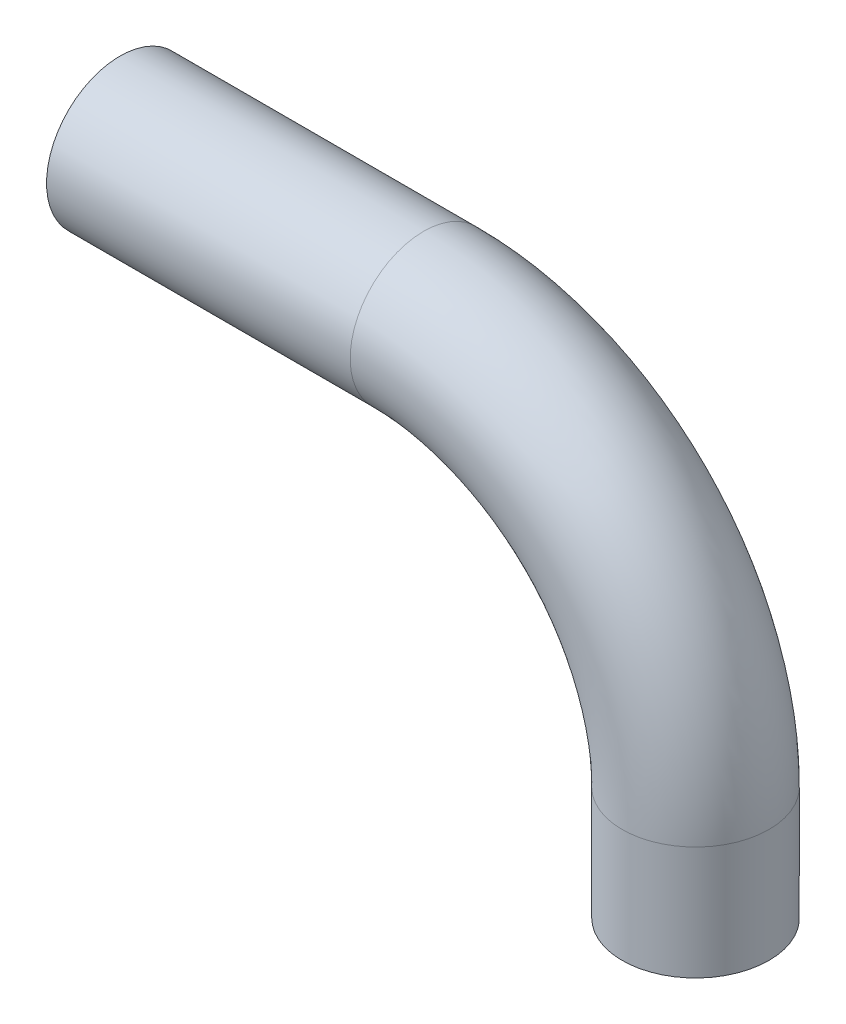
ISO-10303-21;
HEADER;
FILE_DESCRIPTION(('STEP AP214'),'2;1');
FILE_NAME('part.step','',(''),(''),'','','');
FILE_SCHEMA(('AUTOMOTIVE_DESIGN { 1 0 10303 214 1 1 1 1 }'));
ENDSEC;
DATA;
#1=APPLICATION_CONTEXT('core data for automotive mechanical design processes');
#2=APPLICATION_PROTOCOL_DEFINITION('international standard','automotive_design',2000,#1);
#3=PRODUCT_CONTEXT('',#1,'mechanical');
#4=PRODUCT('Part','Part','',(#3));
#5=PRODUCT_RELATED_PRODUCT_CATEGORY('part','',(#4));
#6=PRODUCT_DEFINITION_FORMATION('','',#4);
#7=PRODUCT_DEFINITION_CONTEXT('part definition',#1,'design');
#8=PRODUCT_DEFINITION('design','',#6,#7);
#9=PRODUCT_DEFINITION_SHAPE('','',#8);
#10=(LENGTH_UNIT() NAMED_UNIT(*) SI_UNIT(.MILLI.,.METRE.));
#11=(NAMED_UNIT(*) PLANE_ANGLE_UNIT() SI_UNIT($,.RADIAN.));
#12=(NAMED_UNIT(*) SI_UNIT($,.STERADIAN.) SOLID_ANGLE_UNIT());
#13=UNCERTAINTY_MEASURE_WITH_UNIT(LENGTH_MEASURE(1.E-05),#10,'distance_accuracy_value','');
#14=(GEOMETRIC_REPRESENTATION_CONTEXT(3) GLOBAL_UNCERTAINTY_ASSIGNED_CONTEXT((#13)) GLOBAL_UNIT_ASSIGNED_CONTEXT((#10,
#11,#12)) REPRESENTATION_CONTEXT('',''));
#15=CARTESIAN_POINT('',(0.,0.,0.));
#16=DIRECTION('',(0.,0.,1.));
#17=DIRECTION('',(1.,0.,0.));
#18=AXIS2_PLACEMENT_3D('',#15,#16,#17);
#19=CARTESIAN_POINT('',(0.,0.,0.));
#20=DIRECTION('',(1.,0.,0.));
#21=DIRECTION('',(0.,0.,-1.));
#22=AXIS2_PLACEMENT_3D('',#19,#20,#21);
#23=PLANE('',#22);
#24=CARTESIAN_POINT('',(0.,0.,0.));
#25=DIRECTION('',(1.,0.,0.));
#26=DIRECTION('',(0.,0.,-1.));
#27=AXIS2_PLACEMENT_3D('',#24,#25,#26);
#28=CIRCLE('',#27,13.1);
#29=CARTESIAN_POINT('',(0.,0.,-13.1));
#30=VERTEX_POINT('',#29);
#31=EDGE_CURVE('E61',#30,#30,#28,.T.);
#32=ORIENTED_EDGE('',*,*,#31,.T.);
#33=EDGE_LOOP('',(#32));
#34=FACE_BOUND('',#33,.T.);
#35=CARTESIAN_POINT('',(0.,0.,0.));
#36=DIRECTION('',(1.,0.,0.));
#37=DIRECTION('',(0.,0.,-1.));
#38=AXIS2_PLACEMENT_3D('',#35,#36,#37);
#39=CIRCLE('',#38,13.5000000000005);
#40=CARTESIAN_POINT('',(0.,0.,-13.5000000000005));
#41=VERTEX_POINT('',#40);
#42=EDGE_CURVE('E49',#41,#41,#39,.T.);
#43=ORIENTED_EDGE('',*,*,#42,.F.);
#44=EDGE_LOOP('',(#43));
#45=FACE_BOUND('',#44,.T.);
#46=ADVANCED_FACE('F35',(#34,#45),#23,.F.);
#47=CARTESIAN_POINT('',(105.822460270411,-70.8519707007333,0.));
#48=DIRECTION('',(0.,-1.,0.));
#49=DIRECTION('',(0.,0.,-1.));
#50=AXIS2_PLACEMENT_3D('',#47,#48,#49);
#51=PLANE('',#50);
#52=CARTESIAN_POINT('',(105.822460270411,-70.8519707007333,0.));
#53=DIRECTION('',(0.,-1.,0.));
#54=DIRECTION('',(1.,0.,0.));
#55=AXIS2_PLACEMENT_3D('',#52,#53,#54);
#56=CIRCLE('',#55,13.1);
#57=CARTESIAN_POINT('',(118.922460270411,-70.8519707007333,0.));
#58=VERTEX_POINT('',#57);
#59=EDGE_CURVE('E54',#58,#58,#56,.T.);
#60=ORIENTED_EDGE('',*,*,#59,.F.);
#61=EDGE_LOOP('',(#60));
#62=FACE_BOUND('',#61,.T.);
#63=CARTESIAN_POINT('',(105.822460270411,-70.8519707007333,0.));
#64=DIRECTION('',(0.,-1.,0.));
#65=DIRECTION('',(0.,0.,-1.));
#66=AXIS2_PLACEMENT_3D('',#63,#64,#65);
#67=CIRCLE('',#66,13.5000000000005);
#68=CARTESIAN_POINT('',(105.822460270411,-70.8519707007333,-13.5000000000005));
#69=VERTEX_POINT('',#68);
#70=EDGE_CURVE('E10',#69,#69,#67,.T.);
#71=ORIENTED_EDGE('',*,*,#70,.T.);
#72=EDGE_LOOP('',(#71));
#73=FACE_BOUND('',#72,.T.);
#74=ADVANCED_FACE('F98',(#62,#73),#51,.T.);
#75=CARTESIAN_POINT('',(0.,0.,0.));
#76=DIRECTION('',(1.,0.,0.));
#77=DIRECTION('',(0.,0.,-1.));
#78=AXIS2_PLACEMENT_3D('',#75,#76,#77);
#79=CYLINDRICAL_SURFACE('',#78,13.5000000000005);
#80=CARTESIAN_POINT('',(55.8224602704109,0.,0.));
#81=DIRECTION('',(1.,0.,0.));
#82=DIRECTION('',(0.,0.,-1.));
#83=AXIS2_PLACEMENT_3D('',#80,#81,#82);
#84=CIRCLE('',#83,13.5000000000005);
#85=CARTESIAN_POINT('',(55.8224602704109,13.5000000000005,0.));
#86=VERTEX_POINT('',#85);
#87=EDGE_CURVE('E45',#86,#86,#84,.T.);
#88=ORIENTED_EDGE('',*,*,#87,.F.);
#89=EDGE_LOOP('',(#88));
#90=FACE_BOUND('',#89,.T.);
#91=ORIENTED_EDGE('',*,*,#42,.T.);
#92=EDGE_LOOP('',(#91));
#93=FACE_BOUND('',#92,.T.);
#94=ADVANCED_FACE('F94',(#90,#93),#79,.T.);
#95=CARTESIAN_POINT('',(55.8224602704109,-50.,0.));
#96=DIRECTION('',(0.,0.,-1.));
#97=DIRECTION('',(-1.,0.,0.));
#98=AXIS2_PLACEMENT_3D('',#95,#96,#97);
#99=TOROIDAL_SURFACE('',#98,50.,13.5000000000005);
#100=CARTESIAN_POINT('',(105.822460270411,-50.,0.));
#101=DIRECTION('',(0.,-1.,0.));
#102=DIRECTION('',(0.,0.,-1.));
#103=AXIS2_PLACEMENT_3D('',#100,#101,#102);
#104=CIRCLE('',#103,13.5000000000005);
#105=CARTESIAN_POINT('',(119.322460270411,-50.,0.));
#106=VERTEX_POINT('',#105);
#107=EDGE_CURVE('E41',#106,#106,#104,.T.);
#108=CARTESIAN_POINT('',(55.8224602704109,-50.,0.));
#109=DIRECTION('',(0.,0.,-1.));
#110=DIRECTION('',(-1.,0.,0.));
#111=AXIS2_PLACEMENT_3D('',#108,#109,#110);
#112=CIRCLE('',#111,63.5000000000005);
#113=EDGE_CURVE('',#86,#106,#112,.T.);
#114=ORIENTED_EDGE('',*,*,#87,.T.);
#115=ORIENTED_EDGE('',*,*,#107,.F.);
#116=ORIENTED_EDGE('',*,*,#113,.T.);
#117=ORIENTED_EDGE('',*,*,#113,.F.);
#118=EDGE_LOOP('',(#114,#116,#115,#117));
#119=FACE_BOUND('',#118,.T.);
#120=ADVANCED_FACE('F88',(#119),#99,.T.);
#121=CARTESIAN_POINT('',(105.822460270411,-50.,0.));
#122=DIRECTION('',(0.,-1.,0.));
#123=DIRECTION('',(1.,0.,0.));
#124=AXIS2_PLACEMENT_3D('',#121,#122,#123);
#125=CYLINDRICAL_SURFACE('',#124,13.5000000000005);
#126=ORIENTED_EDGE('',*,*,#70,.F.);
#127=EDGE_LOOP('',(#126));
#128=FACE_BOUND('',#127,.T.);
#129=ORIENTED_EDGE('',*,*,#107,.T.);
#130=EDGE_LOOP('',(#129));
#131=FACE_BOUND('',#130,.T.);
#132=ADVANCED_FACE('F84',(#128,#131),#125,.T.);
#133=CARTESIAN_POINT('',(105.822460270411,-50.,0.));
#134=DIRECTION('',(0.,-1.,0.));
#135=DIRECTION('',(1.,0.,0.));
#136=AXIS2_PLACEMENT_3D('',#133,#134,#135);
#137=CYLINDRICAL_SURFACE('',#136,13.1);
#138=CARTESIAN_POINT('',(105.822460270411,-50.,0.));
#139=DIRECTION('',(0.,1.,0.));
#140=DIRECTION('',(0.,0.,1.));
#141=AXIS2_PLACEMENT_3D('',#138,#139,#140);
#142=CIRCLE('',#141,13.1);
#143=CARTESIAN_POINT('',(118.922460270411,-50.,0.));
#144=VERTEX_POINT('',#143);
#145=EDGE_CURVE('E57',#144,#144,#142,.T.);
#146=ORIENTED_EDGE('',*,*,#145,.T.);
#147=EDGE_LOOP('',(#146));
#148=FACE_BOUND('',#147,.T.);
#149=ORIENTED_EDGE('',*,*,#59,.T.);
#150=EDGE_LOOP('',(#149));
#151=FACE_BOUND('',#150,.T.);
#152=ADVANCED_FACE('F73',(#148,#151),#137,.F.);
#153=CARTESIAN_POINT('',(-4.99999999999999,0.,0.));
#154=DIRECTION('',(1.,0.,0.));
#155=DIRECTION('',(0.,0.,-1.));
#156=AXIS2_PLACEMENT_3D('',#153,#154,#155);
#157=CYLINDRICAL_SURFACE('',#156,13.1);
#158=ORIENTED_EDGE('',*,*,#31,.F.);
#159=EDGE_LOOP('',(#158));
#160=FACE_BOUND('',#159,.T.);
#161=CARTESIAN_POINT('',(55.8224602704109,0.,0.));
#162=DIRECTION('',(-1.,0.,0.));
#163=DIRECTION('',(0.,0.,1.));
#164=AXIS2_PLACEMENT_3D('',#161,#162,#163);
#165=CIRCLE('',#164,13.1);
#166=CARTESIAN_POINT('',(55.8224602704109,13.1,0.));
#167=VERTEX_POINT('',#166);
#168=EDGE_CURVE('E58',#167,#167,#165,.T.);
#169=ORIENTED_EDGE('',*,*,#168,.F.);
#170=EDGE_LOOP('',(#169));
#171=FACE_BOUND('',#170,.T.);
#172=ADVANCED_FACE('F69',(#160,#171),#157,.F.);
#173=CARTESIAN_POINT('',(55.8224602704109,-50.,0.));
#174=DIRECTION('',(0.,0.,-1.));
#175=DIRECTION('',(-1.,0.,0.));
#176=AXIS2_PLACEMENT_3D('',#173,#174,#175);
#177=TOROIDAL_SURFACE('',#176,50.,13.1);
#178=CARTESIAN_POINT('',(55.8224602704109,-50.,0.));
#179=DIRECTION('',(0.,0.,-1.));
#180=DIRECTION('',(-1.,0.,0.));
#181=AXIS2_PLACEMENT_3D('',#178,#179,#180);
#182=CIRCLE('',#181,63.1);
#183=EDGE_CURVE('',#167,#144,#182,.T.);
#184=ORIENTED_EDGE('',*,*,#168,.T.);
#185=ORIENTED_EDGE('',*,*,#145,.F.);
#186=ORIENTED_EDGE('',*,*,#183,.T.);
#187=ORIENTED_EDGE('',*,*,#183,.F.);
#188=EDGE_LOOP('',(#184,#186,#185,#187));
#189=FACE_BOUND('',#188,.T.);
#190=ADVANCED_FACE('F72',(#189),#177,.F.);
#191=CLOSED_SHELL('',(#46,#74,#94,#120,#132,#152,#172,#190));
#192=MANIFOLD_SOLID_BREP('B2',#191);
#193=ADVANCED_BREP_SHAPE_REPRESENTATION('',(#18,#192),#14);
#194=SHAPE_DEFINITION_REPRESENTATION(#9,#193);
ENDSEC;
END-ISO-10303-21;
